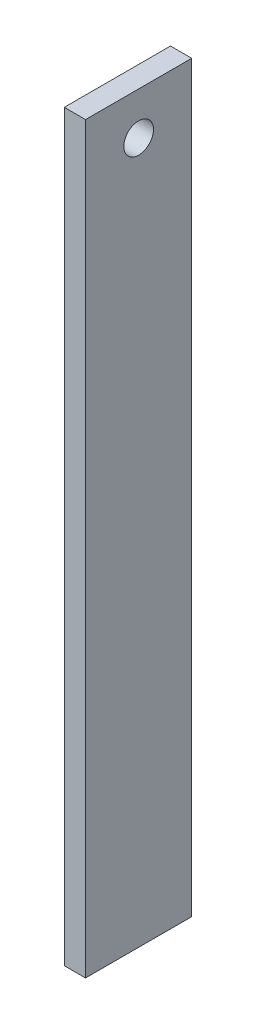
ISO-10303-21;
HEADER;
FILE_DESCRIPTION(('STEP AP214'),'2;1');
FILE_NAME('part.step','',(''),(''),'','','');
FILE_SCHEMA(('AUTOMOTIVE_DESIGN { 1 0 10303 214 1 1 1 1 }'));
ENDSEC;
DATA;
#1=APPLICATION_CONTEXT('core data for automotive mechanical design processes');
#2=APPLICATION_PROTOCOL_DEFINITION('international standard','automotive_design',2000,#1);
#3=PRODUCT_CONTEXT('',#1,'mechanical');
#4=PRODUCT('Part','Part','',(#3));
#5=PRODUCT_RELATED_PRODUCT_CATEGORY('part','',(#4));
#6=PRODUCT_DEFINITION_FORMATION('','',#4);
#7=PRODUCT_DEFINITION_CONTEXT('part definition',#1,'design');
#8=PRODUCT_DEFINITION('design','',#6,#7);
#9=PRODUCT_DEFINITION_SHAPE('','',#8);
#10=(LENGTH_UNIT() NAMED_UNIT(*) SI_UNIT(.MILLI.,.METRE.));
#11=(NAMED_UNIT(*) PLANE_ANGLE_UNIT() SI_UNIT($,.RADIAN.));
#12=(NAMED_UNIT(*) SI_UNIT($,.STERADIAN.) SOLID_ANGLE_UNIT());
#13=UNCERTAINTY_MEASURE_WITH_UNIT(LENGTH_MEASURE(1.E-05),#10,'distance_accuracy_value','');
#14=(GEOMETRIC_REPRESENTATION_CONTEXT(3) GLOBAL_UNCERTAINTY_ASSIGNED_CONTEXT((#13)) GLOBAL_UNIT_ASSIGNED_CONTEXT((#10,
#11,#12)) REPRESENTATION_CONTEXT('',''));
#15=CARTESIAN_POINT('',(0.,0.,0.));
#16=DIRECTION('',(0.,0.,1.));
#17=DIRECTION('',(1.,0.,0.));
#18=AXIS2_PLACEMENT_3D('',#15,#16,#17);
#19=CARTESIAN_POINT('',(-35.,360.000000000001,-25.));
#20=DIRECTION('',(0.,0.,1.));
#21=DIRECTION('',(1.,0.,0.));
#22=AXIS2_PLACEMENT_3D('',#19,#20,#21);
#23=PLANE('',#22);
#24=DIRECTION('',(1.,0.,0.));
#25=VECTOR('',#24,1.);
#26=CARTESIAN_POINT('',(-53.,10.0000000000001,-25.0000000000001));
#27=LINE('',#26,#25);
#28=CARTESIAN_POINT('',(-35.,10.,-24.9999999999998));
#29=VERTEX_POINT('',#28);
#30=CARTESIAN_POINT('',(-25.,10.0000000000002,-25.0000000000001));
#31=VERTEX_POINT('',#30);
#32=EDGE_CURVE('E49',#29,#31,#27,.T.);
#33=ORIENTED_EDGE('',*,*,#32,.F.);
#34=DIRECTION('',(0.,-1.,0.));
#35=VECTOR('',#34,1.);
#36=CARTESIAN_POINT('',(-35.,360.000000000001,-25.));
#37=LINE('',#36,#35);
#38=CARTESIAN_POINT('',(-35.,360.000000000001,-25.));
#39=VERTEX_POINT('',#38);
#40=EDGE_CURVE('E98',#39,#29,#37,.T.);
#41=ORIENTED_EDGE('',*,*,#40,.F.);
#42=DIRECTION('',(-1.,0.,0.));
#43=VECTOR('',#42,1.);
#44=CARTESIAN_POINT('',(-35.,360.000000000001,-25.));
#45=LINE('',#44,#43);
#46=CARTESIAN_POINT('',(-25.,360.000000000001,-25.0000000000001));
#47=VERTEX_POINT('',#46);
#48=EDGE_CURVE('E83',#47,#39,#45,.T.);
#49=ORIENTED_EDGE('',*,*,#48,.F.);
#50=DIRECTION('',(0.,-1.,0.));
#51=VECTOR('',#50,1.);
#52=CARTESIAN_POINT('',(-25.,360.000000000001,-25.0000000000001));
#53=LINE('',#52,#51);
#54=EDGE_CURVE('E43',#47,#31,#53,.T.);
#55=ORIENTED_EDGE('',*,*,#54,.T.);
#56=EDGE_LOOP('',(#33,#41,#49,#55));
#57=FACE_BOUND('',#56,.T.);
#58=ADVANCED_FACE('F40',(#57),#23,.F.);
#59=CARTESIAN_POINT('',(-35.,360.000000000001,-25.));
#60=DIRECTION('',(1.,0.,0.));
#61=DIRECTION('',(0.,0.,-1.));
#62=AXIS2_PLACEMENT_3D('',#59,#60,#61);
#63=PLANE('',#62);
#64=CARTESIAN_POINT('',(-35.,340.000000000001,2.77555756156289E-13));
#65=DIRECTION('',(-1.,0.,0.));
#66=DIRECTION('',(0.,0.,1.));
#67=AXIS2_PLACEMENT_3D('',#64,#65,#66);
#68=CIRCLE('',#67,7.00000000000001);
#69=CARTESIAN_POINT('',(-35.,340.000000000001,7.00000000000029));
#70=VERTEX_POINT('',#69);
#71=EDGE_CURVE('E158',#70,#70,#68,.T.);
#72=ORIENTED_EDGE('',*,*,#71,.F.);
#73=EDGE_LOOP('',(#72));
#74=FACE_BOUND('',#73,.T.);
#75=DIRECTION('',(0.,0.,-1.));
#76=VECTOR('',#75,1.);
#77=CARTESIAN_POINT('',(-35.,10.0000000000001,-25.));
#78=LINE('',#77,#76);
#79=CARTESIAN_POINT('',(-35.,10.0000000000001,25.));
#80=VERTEX_POINT('',#79);
#81=EDGE_CURVE('E91',#80,#29,#78,.T.);
#82=ORIENTED_EDGE('',*,*,#81,.F.);
#83=DIRECTION('',(0.,-1.,0.));
#84=VECTOR('',#83,1.);
#85=CARTESIAN_POINT('',(-35.,360.000000000001,25.0000000000002));
#86=LINE('',#85,#84);
#87=CARTESIAN_POINT('',(-35.,360.000000000001,25.0000000000002));
#88=VERTEX_POINT('',#87);
#89=EDGE_CURVE('E109',#88,#80,#86,.T.);
#90=ORIENTED_EDGE('',*,*,#89,.F.);
#91=DIRECTION('',(0.,0.,1.));
#92=VECTOR('',#91,1.);
#93=CARTESIAN_POINT('',(-35.,360.000000000001,-25.));
#94=LINE('',#93,#92);
#95=EDGE_CURVE('E102',#39,#88,#94,.T.);
#96=ORIENTED_EDGE('',*,*,#95,.F.);
#97=ORIENTED_EDGE('',*,*,#40,.T.);
#98=EDGE_LOOP('',(#82,#90,#96,#97));
#99=FACE_BOUND('',#98,.T.);
#100=ADVANCED_FACE('F128',(#74,#99),#63,.F.);
#101=CARTESIAN_POINT('',(-25.,360.000000000001,24.9999999999998));
#102=DIRECTION('',(0.,0.,-1.));
#103=DIRECTION('',(-1.,0.,0.));
#104=AXIS2_PLACEMENT_3D('',#101,#102,#103);
#105=PLANE('',#104);
#106=DIRECTION('',(1.,0.,0.));
#107=VECTOR('',#106,1.);
#108=CARTESIAN_POINT('',(-53.,10.,24.9999999999999));
#109=LINE('',#108,#107);
#110=CARTESIAN_POINT('',(-25.,10.0000000000001,25.));
#111=VERTEX_POINT('',#110);
#112=EDGE_CURVE('E56',#80,#111,#109,.T.);
#113=ORIENTED_EDGE('',*,*,#112,.T.);
#114=DIRECTION('',(0.,-1.,0.));
#115=VECTOR('',#114,1.);
#116=CARTESIAN_POINT('',(-25.,360.000000000001,24.9999999999998));
#117=LINE('',#116,#115);
#118=CARTESIAN_POINT('',(-25.,360.000000000001,24.9999999999998));
#119=VERTEX_POINT('',#118);
#120=EDGE_CURVE('E103',#119,#111,#117,.T.);
#121=ORIENTED_EDGE('',*,*,#120,.F.);
#122=DIRECTION('',(1.,0.,0.));
#123=VECTOR('',#122,1.);
#124=CARTESIAN_POINT('',(-25.,360.000000000001,24.9999999999998));
#125=LINE('',#124,#123);
#126=EDGE_CURVE('E86',#88,#119,#125,.T.);
#127=ORIENTED_EDGE('',*,*,#126,.F.);
#128=ORIENTED_EDGE('',*,*,#89,.T.);
#129=EDGE_LOOP('',(#113,#121,#127,#128));
#130=FACE_BOUND('',#129,.T.);
#131=ADVANCED_FACE('F126',(#130),#105,.F.);
#132=CARTESIAN_POINT('',(-25.,360.000000000001,-25.0000000000001));
#133=DIRECTION('',(-1.,0.,0.));
#134=DIRECTION('',(0.,0.,1.));
#135=AXIS2_PLACEMENT_3D('',#132,#133,#134);
#136=PLANE('',#135);
#137=CARTESIAN_POINT('',(-25.,340.000000000001,3.88578058618805E-13));
#138=DIRECTION('',(-1.,0.,0.));
#139=DIRECTION('',(0.,0.,1.));
#140=AXIS2_PLACEMENT_3D('',#137,#138,#139);
#141=CIRCLE('',#140,7.00000000000001);
#142=CARTESIAN_POINT('',(-25.,340.000000000001,7.00000000000041));
#143=VERTEX_POINT('',#142);
#144=EDGE_CURVE('E99',#143,#143,#141,.T.);
#145=ORIENTED_EDGE('',*,*,#144,.T.);
#146=EDGE_LOOP('',(#145));
#147=FACE_BOUND('',#146,.T.);
#148=DIRECTION('',(0.,0.,1.));
#149=VECTOR('',#148,1.);
#150=CARTESIAN_POINT('',(-25.,10.0000000000001,-25.));
#151=LINE('',#150,#149);
#152=EDGE_CURVE('E11',#31,#111,#151,.T.);
#153=ORIENTED_EDGE('',*,*,#152,.F.);
#154=ORIENTED_EDGE('',*,*,#54,.F.);
#155=DIRECTION('',(0.,0.,-1.));
#156=VECTOR('',#155,1.);
#157=CARTESIAN_POINT('',(-25.,360.000000000001,-25.0000000000001));
#158=LINE('',#157,#156);
#159=EDGE_CURVE('E79',#119,#47,#158,.T.);
#160=ORIENTED_EDGE('',*,*,#159,.F.);
#161=ORIENTED_EDGE('',*,*,#120,.T.);
#162=EDGE_LOOP('',(#153,#154,#160,#161));
#163=FACE_BOUND('',#162,.T.);
#164=ADVANCED_FACE('F94',(#147,#163),#136,.F.);
#165=CARTESIAN_POINT('',(-83.,360.,-1.66533453693773E-13));
#166=DIRECTION('',(0.,-1.,0.));
#167=DIRECTION('',(1.,0.,0.));
#168=AXIS2_PLACEMENT_3D('',#165,#166,#167);
#169=PLANE('',#168);
#170=ORIENTED_EDGE('',*,*,#48,.T.);
#171=ORIENTED_EDGE('',*,*,#95,.T.);
#172=ORIENTED_EDGE('',*,*,#126,.T.);
#173=ORIENTED_EDGE('',*,*,#159,.T.);
#174=EDGE_LOOP('',(#170,#171,#172,#173));
#175=FACE_BOUND('',#174,.T.);
#176=ADVANCED_FACE('F81',(#175),#169,.F.);
#177=CARTESIAN_POINT('',(-53.,10.0000000000001,-25.0000000000001));
#178=DIRECTION('',(0.,-1.,0.));
#179=DIRECTION('',(1.,0.,0.));
#180=AXIS2_PLACEMENT_3D('',#177,#178,#179);
#181=PLANE('',#180);
#182=ORIENTED_EDGE('',*,*,#81,.T.);
#183=ORIENTED_EDGE('',*,*,#32,.T.);
#184=ORIENTED_EDGE('',*,*,#152,.T.);
#185=ORIENTED_EDGE('',*,*,#112,.F.);
#186=EDGE_LOOP('',(#182,#183,#184,#185));
#187=FACE_BOUND('',#186,.T.);
#188=ADVANCED_FACE('F129',(#187),#181,.T.);
#189=CARTESIAN_POINT('',(-35.,340.000000000001,2.77555756156289E-13));
#190=DIRECTION('',(-1.,0.,0.));
#191=DIRECTION('',(0.,0.,1.));
#192=AXIS2_PLACEMENT_3D('',#189,#190,#191);
#193=CYLINDRICAL_SURFACE('',#192,7.00000000000001);
#194=ORIENTED_EDGE('',*,*,#71,.T.);
#195=EDGE_LOOP('',(#194));
#196=FACE_BOUND('',#195,.T.);
#197=ORIENTED_EDGE('',*,*,#144,.F.);
#198=EDGE_LOOP('',(#197));
#199=FACE_BOUND('',#198,.T.);
#200=ADVANCED_FACE('F131',(#196,#199),#193,.F.);
#201=CLOSED_SHELL('',(#58,#100,#131,#164,#176,#188,#200));
#202=MANIFOLD_SOLID_BREP('B2',#201);
#203=ADVANCED_BREP_SHAPE_REPRESENTATION('',(#18,#202),#14);
#204=SHAPE_DEFINITION_REPRESENTATION(#9,#203);
ENDSEC;
END-ISO-10303-21;
